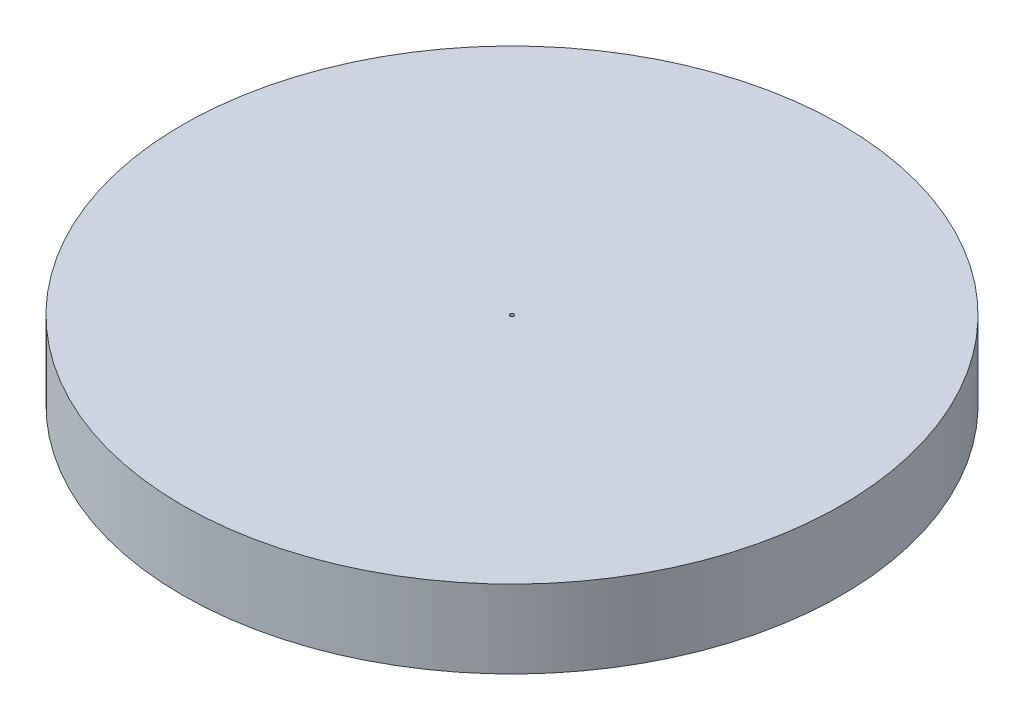
ISO-10303-21;
HEADER;
FILE_DESCRIPTION(('STEP AP214'),'2;1');
FILE_NAME('part.step','',(''),(''),'','','');
FILE_SCHEMA(('AUTOMOTIVE_DESIGN { 1 0 10303 214 1 1 1 1 }'));
ENDSEC;
DATA;
#1=APPLICATION_CONTEXT('core data for automotive mechanical design processes');
#2=APPLICATION_PROTOCOL_DEFINITION('international standard','automotive_design',2000,#1);
#3=PRODUCT_CONTEXT('',#1,'mechanical');
#4=PRODUCT('Part','Part','',(#3));
#5=PRODUCT_RELATED_PRODUCT_CATEGORY('part','',(#4));
#6=PRODUCT_DEFINITION_FORMATION('','',#4);
#7=PRODUCT_DEFINITION_CONTEXT('part definition',#1,'design');
#8=PRODUCT_DEFINITION('design','',#6,#7);
#9=PRODUCT_DEFINITION_SHAPE('','',#8);
#10=(LENGTH_UNIT() NAMED_UNIT(*) SI_UNIT(.MILLI.,.METRE.));
#11=(NAMED_UNIT(*) PLANE_ANGLE_UNIT() SI_UNIT($,.RADIAN.));
#12=(NAMED_UNIT(*) SI_UNIT($,.STERADIAN.) SOLID_ANGLE_UNIT());
#13=UNCERTAINTY_MEASURE_WITH_UNIT(LENGTH_MEASURE(1.E-05),#10,'distance_accuracy_value','');
#14=(GEOMETRIC_REPRESENTATION_CONTEXT(3) GLOBAL_UNCERTAINTY_ASSIGNED_CONTEXT((#13)) GLOBAL_UNIT_ASSIGNED_CONTEXT((#10,
#11,#12)) REPRESENTATION_CONTEXT('',''));
#15=CARTESIAN_POINT('',(0.,0.,0.));
#16=DIRECTION('',(0.,0.,1.));
#17=DIRECTION('',(1.,0.,0.));
#18=AXIS2_PLACEMENT_3D('',#15,#16,#17);
#19=CARTESIAN_POINT('',(0.,3.,0.));
#20=DIRECTION('',(0.,1.,0.));
#21=DIRECTION('',(0.,0.,1.));
#22=AXIS2_PLACEMENT_3D('',#19,#20,#21);
#23=PLANE('',#22);
#24=CARTESIAN_POINT('',(0.,3.,0.));
#25=DIRECTION('',(0.,1.,0.));
#26=DIRECTION('',(0.,0.,1.));
#27=AXIS2_PLACEMENT_3D('',#24,#25,#26);
#28=CIRCLE('',#27,12.7);
#29=CARTESIAN_POINT('',(0.,3.,12.7));
#30=VERTEX_POINT('',#29);
#31=EDGE_CURVE('E10',#30,#30,#28,.T.);
#32=ORIENTED_EDGE('',*,*,#31,.T.);
#33=EDGE_LOOP('',(#32));
#34=FACE_BOUND('',#33,.T.);
#35=CARTESIAN_POINT('',(0.,3.,0.));
#36=DIRECTION('',(0.,1.,0.));
#37=DIRECTION('',(0.,0.,1.));
#38=AXIS2_PLACEMENT_3D('',#35,#36,#37);
#39=CIRCLE('',#38,0.075);
#40=CARTESIAN_POINT('',(0.,3.,0.075));
#41=VERTEX_POINT('',#40);
#42=EDGE_CURVE('E43',#41,#41,#39,.T.);
#43=ORIENTED_EDGE('',*,*,#42,.F.);
#44=EDGE_LOOP('',(#43));
#45=FACE_BOUND('',#44,.T.);
#46=ADVANCED_FACE('F32',(#34,#45),#23,.T.);
#47=CARTESIAN_POINT('',(0.,0.,0.));
#48=DIRECTION('',(0.,1.,0.));
#49=DIRECTION('',(0.,0.,1.));
#50=AXIS2_PLACEMENT_3D('',#47,#48,#49);
#51=PLANE('',#50);
#52=CARTESIAN_POINT('',(0.,0.,0.));
#53=DIRECTION('',(0.,1.,0.));
#54=DIRECTION('',(0.,0.,1.));
#55=AXIS2_PLACEMENT_3D('',#52,#53,#54);
#56=CIRCLE('',#55,12.7);
#57=CARTESIAN_POINT('',(0.,0.,12.7));
#58=VERTEX_POINT('',#57);
#59=EDGE_CURVE('E36',#58,#58,#56,.T.);
#60=ORIENTED_EDGE('',*,*,#59,.F.);
#61=EDGE_LOOP('',(#60));
#62=FACE_BOUND('',#61,.T.);
#63=CARTESIAN_POINT('',(0.,0.,0.));
#64=DIRECTION('',(0.,1.,0.));
#65=DIRECTION('',(0.,0.,1.));
#66=AXIS2_PLACEMENT_3D('',#63,#64,#65);
#67=CIRCLE('',#66,0.075);
#68=CARTESIAN_POINT('',(0.,0.,0.075));
#69=VERTEX_POINT('',#68);
#70=EDGE_CURVE('E45',#69,#69,#67,.T.);
#71=ORIENTED_EDGE('',*,*,#70,.T.);
#72=EDGE_LOOP('',(#71));
#73=FACE_BOUND('',#72,.T.);
#74=ADVANCED_FACE('F55',(#62,#73),#51,.F.);
#75=CARTESIAN_POINT('',(0.,3.,0.));
#76=DIRECTION('',(0.,-1.,0.));
#77=DIRECTION('',(0.,0.,-1.));
#78=AXIS2_PLACEMENT_3D('',#75,#76,#77);
#79=CYLINDRICAL_SURFACE('',#78,12.7);
#80=ORIENTED_EDGE('',*,*,#31,.F.);
#81=EDGE_LOOP('',(#80));
#82=FACE_BOUND('',#81,.T.);
#83=ORIENTED_EDGE('',*,*,#59,.T.);
#84=EDGE_LOOP('',(#83));
#85=FACE_BOUND('',#84,.T.);
#86=ADVANCED_FACE('F34',(#82,#85),#79,.T.);
#87=CARTESIAN_POINT('',(0.,3.,0.));
#88=DIRECTION('',(0.,-1.,0.));
#89=DIRECTION('',(0.,0.,-1.));
#90=AXIS2_PLACEMENT_3D('',#87,#88,#89);
#91=CYLINDRICAL_SURFACE('',#90,0.075);
#92=ORIENTED_EDGE('',*,*,#42,.T.);
#93=EDGE_LOOP('',(#92));
#94=FACE_BOUND('',#93,.T.);
#95=ORIENTED_EDGE('',*,*,#70,.F.);
#96=EDGE_LOOP('',(#95));
#97=FACE_BOUND('',#96,.T.);
#98=ADVANCED_FACE('F51',(#94,#97),#91,.F.);
#99=CLOSED_SHELL('',(#46,#74,#86,#98));
#100=MANIFOLD_SOLID_BREP('B2',#99);
#101=ADVANCED_BREP_SHAPE_REPRESENTATION('',(#18,#100),#14);
#102=SHAPE_DEFINITION_REPRESENTATION(#9,#101);
ENDSEC;
END-ISO-10303-21;
